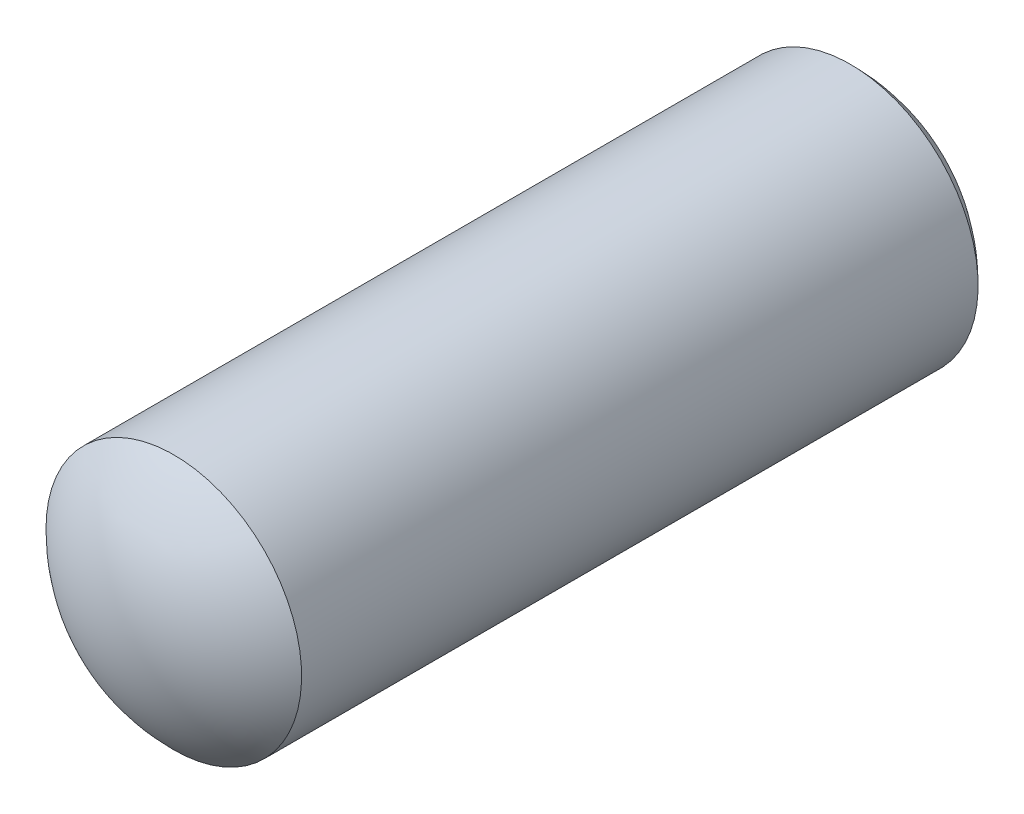
ISO-10303-21;
HEADER;
FILE_DESCRIPTION(('STEP AP214'),'2;1');
FILE_NAME('part.step','',(''),(''),'','','');
FILE_SCHEMA(('AUTOMOTIVE_DESIGN { 1 0 10303 214 1 1 1 1 }'));
ENDSEC;
DATA;
#1=APPLICATION_CONTEXT('core data for automotive mechanical design processes');
#2=APPLICATION_PROTOCOL_DEFINITION('international standard','automotive_design',2000,#1);
#3=PRODUCT_CONTEXT('',#1,'mechanical');
#4=PRODUCT('Part','Part','',(#3));
#5=PRODUCT_RELATED_PRODUCT_CATEGORY('part','',(#4));
#6=PRODUCT_DEFINITION_FORMATION('','',#4);
#7=PRODUCT_DEFINITION_CONTEXT('part definition',#1,'design');
#8=PRODUCT_DEFINITION('design','',#6,#7);
#9=PRODUCT_DEFINITION_SHAPE('','',#8);
#10=(LENGTH_UNIT() NAMED_UNIT(*) SI_UNIT(.MILLI.,.METRE.));
#11=(NAMED_UNIT(*) PLANE_ANGLE_UNIT() SI_UNIT($,.RADIAN.));
#12=(NAMED_UNIT(*) SI_UNIT($,.STERADIAN.) SOLID_ANGLE_UNIT());
#13=UNCERTAINTY_MEASURE_WITH_UNIT(LENGTH_MEASURE(1.E-05),#10,'distance_accuracy_value','');
#14=(GEOMETRIC_REPRESENTATION_CONTEXT(3) GLOBAL_UNCERTAINTY_ASSIGNED_CONTEXT((#13)) GLOBAL_UNIT_ASSIGNED_CONTEXT((#10,
#11,#12)) REPRESENTATION_CONTEXT('',''));
#15=CARTESIAN_POINT('',(0.,0.,0.));
#16=DIRECTION('',(0.,0.,1.));
#17=DIRECTION('',(1.,0.,0.));
#18=AXIS2_PLACEMENT_3D('',#15,#16,#17);
#19=CARTESIAN_POINT('',(-9.03212065716347,1.29862289924376,7.875));
#20=DIRECTION('',(0.142314838273285,0.989821441880933,0.));
#21=DIRECTION('',(0.,0.,1.));
#22=AXIS2_PLACEMENT_3D('',#19,#20,#21);
#23=SPHERICAL_SURFACE('',#22,1.575);
#24=CARTESIAN_POINT('',(-9.03212065716347,1.29862289924376,7.875));
#25=DIRECTION('',(0.,0.,1.));
#26=DIRECTION('',(0.989821441880933,-0.142314838273285,0.));
#27=AXIS2_PLACEMENT_3D('',#24,#25,#26);
#28=SPHERICAL_SURFACE('',#27,1.575);
#29=CARTESIAN_POINT('',(-9.03212065716347,1.29862289924376,8.97727038425245));
#30=DIRECTION('',(0.,0.,1.));
#31=DIRECTION('',(0.989821441880933,-0.142314838273285,0.));
#32=AXIS2_PLACEMENT_3D('',#29,#30,#31);
#33=CIRCLE('',#32,1.125);
#34=CARTESIAN_POINT('',(-7.91857153504742,1.13851870618632,8.97727038425245));
#35=VERTEX_POINT('',#34);
#36=EDGE_CURVE('E11',#35,#35,#33,.T.);
#37=ORIENTED_EDGE('',*,*,#36,.T.);
#38=EDGE_LOOP('',(#37));
#39=FACE_BOUND('',#38,.T.);
#40=ADVANCED_FACE('F17',(#39),#28,.T.);
#41=CARTESIAN_POINT('',(-9.03212065716347,1.29862289924376,6.));
#42=DIRECTION('',(0.,0.,1.));
#43=DIRECTION('',(0.989821441880933,-0.142314838273285,0.));
#44=AXIS2_PLACEMENT_3D('',#41,#42,#43);
#45=CYLINDRICAL_SURFACE('',#44,1.125);
#46=CARTESIAN_POINT('',(-9.03212065716348,1.29862289924376,3.02272961574759));
#47=DIRECTION('',(0.,0.,1.));
#48=DIRECTION('',(0.989821441880933,-0.142314838273285,0.));
#49=AXIS2_PLACEMENT_3D('',#46,#47,#48);
#50=CIRCLE('',#49,1.125);
#51=CARTESIAN_POINT('',(-7.91857153504743,1.13851870618632,3.02272961574759));
#52=VERTEX_POINT('',#51);
#53=EDGE_CURVE('E20',#52,#52,#50,.T.);
#54=ORIENTED_EDGE('',*,*,#53,.T.);
#55=EDGE_LOOP('',(#54));
#56=FACE_BOUND('',#55,.T.);
#57=ORIENTED_EDGE('',*,*,#36,.F.);
#58=EDGE_LOOP('',(#57));
#59=FACE_BOUND('',#58,.T.);
#60=ADVANCED_FACE('F39',(#56,#59),#45,.T.);
#61=CARTESIAN_POINT('',(-9.03212065716347,1.29862289924376,4.125));
#62=DIRECTION('',(0.142314838273285,0.989821441880933,0.));
#63=DIRECTION('',(0.,0.,-1.));
#64=AXIS2_PLACEMENT_3D('',#61,#62,#63);
#65=SPHERICAL_SURFACE('',#64,1.575);
#66=CARTESIAN_POINT('',(-9.03212065716347,1.29862289924376,4.125));
#67=DIRECTION('',(0.,0.,1.));
#68=DIRECTION('',(0.989821441880933,-0.142314838273285,0.));
#69=AXIS2_PLACEMENT_3D('',#66,#67,#68);
#70=SPHERICAL_SURFACE('',#69,1.575);
#71=ORIENTED_EDGE('',*,*,#53,.F.);
#72=EDGE_LOOP('',(#71));
#73=FACE_BOUND('',#72,.T.);
#74=ADVANCED_FACE('F52',(#73),#70,.T.);
#75=CLOSED_SHELL('',(#40,#60,#74));
#76=MANIFOLD_SOLID_BREP('B1',#75);
#77=ADVANCED_BREP_SHAPE_REPRESENTATION('',(#18,#76),#14);
#78=SHAPE_DEFINITION_REPRESENTATION(#9,#77);
ENDSEC;
END-ISO-10303-21;
